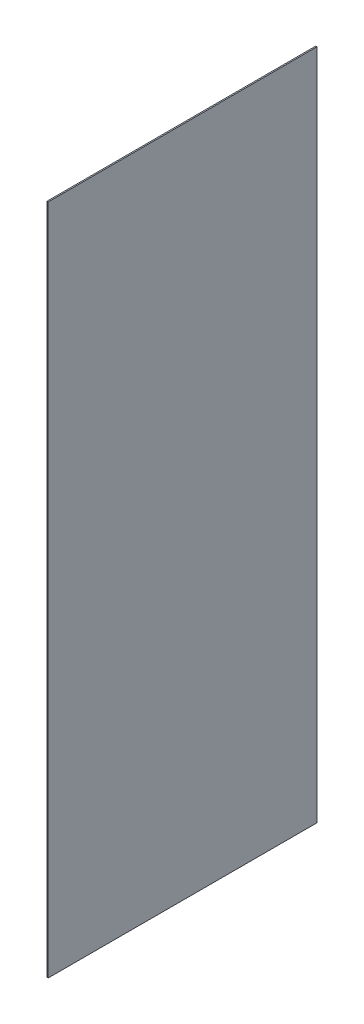
ISO-10303-21;
HEADER;
FILE_DESCRIPTION(('STEP AP214'),'2;1');
FILE_NAME('part.step','',(''),(''),'','','');
FILE_SCHEMA(('AUTOMOTIVE_DESIGN { 1 0 10303 214 1 1 1 1 }'));
ENDSEC;
DATA;
#1=APPLICATION_CONTEXT('core data for automotive mechanical design processes');
#2=APPLICATION_PROTOCOL_DEFINITION('international standard','automotive_design',2000,#1);
#3=PRODUCT_CONTEXT('',#1,'mechanical');
#4=PRODUCT('Part','Part','',(#3));
#5=PRODUCT_RELATED_PRODUCT_CATEGORY('part','',(#4));
#6=PRODUCT_DEFINITION_FORMATION('','',#4);
#7=PRODUCT_DEFINITION_CONTEXT('part definition',#1,'design');
#8=PRODUCT_DEFINITION('design','',#6,#7);
#9=PRODUCT_DEFINITION_SHAPE('','',#8);
#10=(LENGTH_UNIT() NAMED_UNIT(*) SI_UNIT(.MILLI.,.METRE.));
#11=(NAMED_UNIT(*) PLANE_ANGLE_UNIT() SI_UNIT($,.RADIAN.));
#12=(NAMED_UNIT(*) SI_UNIT($,.STERADIAN.) SOLID_ANGLE_UNIT());
#13=UNCERTAINTY_MEASURE_WITH_UNIT(LENGTH_MEASURE(1.E-05),#10,'distance_accuracy_value','');
#14=(GEOMETRIC_REPRESENTATION_CONTEXT(3) GLOBAL_UNCERTAINTY_ASSIGNED_CONTEXT((#13)) GLOBAL_UNIT_ASSIGNED_CONTEXT((#10,
#11,#12)) REPRESENTATION_CONTEXT('',''));
#15=CARTESIAN_POINT('',(0.,0.,0.));
#16=DIRECTION('',(0.,0.,1.));
#17=DIRECTION('',(1.,0.,0.));
#18=AXIS2_PLACEMENT_3D('',#15,#16,#17);
#19=CARTESIAN_POINT('',(-1.2,-325.,130.));
#20=DIRECTION('',(0.,0.,1.));
#21=DIRECTION('',(1.,0.,0.));
#22=AXIS2_PLACEMENT_3D('',#19,#20,#21);
#23=PLANE('',#22);
#24=DIRECTION('',(0.,-1.,0.));
#25=VECTOR('',#24,1.);
#26=CARTESIAN_POINT('',(0.,-325.,130.));
#27=LINE('',#26,#25);
#28=CARTESIAN_POINT('',(0.,325.,130.));
#29=VERTEX_POINT('',#28);
#30=CARTESIAN_POINT('',(0.,-325.,130.));
#31=VERTEX_POINT('',#30);
#32=EDGE_CURVE('E107',#29,#31,#27,.T.);
#33=ORIENTED_EDGE('',*,*,#32,.F.);
#34=DIRECTION('',(1.,0.,0.));
#35=VECTOR('',#34,1.);
#36=CARTESIAN_POINT('',(-1.2,325.,130.));
#37=LINE('',#36,#35);
#38=CARTESIAN_POINT('',(-1.2,325.,130.));
#39=VERTEX_POINT('',#38);
#40=EDGE_CURVE('E11',#39,#29,#37,.T.);
#41=ORIENTED_EDGE('',*,*,#40,.F.);
#42=DIRECTION('',(0.,-1.,0.));
#43=VECTOR('',#42,1.);
#44=CARTESIAN_POINT('',(-1.2,-325.,130.));
#45=LINE('',#44,#43);
#46=CARTESIAN_POINT('',(-1.2,-325.,130.));
#47=VERTEX_POINT('',#46);
#48=EDGE_CURVE('E101',#39,#47,#45,.T.);
#49=ORIENTED_EDGE('',*,*,#48,.T.);
#50=DIRECTION('',(1.,0.,0.));
#51=VECTOR('',#50,1.);
#52=CARTESIAN_POINT('',(-1.2,-325.,130.));
#53=LINE('',#52,#51);
#54=EDGE_CURVE('E46',#47,#31,#53,.T.);
#55=ORIENTED_EDGE('',*,*,#54,.T.);
#56=EDGE_LOOP('',(#33,#41,#49,#55));
#57=FACE_BOUND('',#56,.T.);
#58=ADVANCED_FACE('F43',(#57),#23,.T.);
#59=CARTESIAN_POINT('',(-1.2,325.,-130.));
#60=DIRECTION('',(0.,1.,0.));
#61=DIRECTION('',(0.,0.,1.));
#62=AXIS2_PLACEMENT_3D('',#59,#60,#61);
#63=PLANE('',#62);
#64=DIRECTION('',(0.,0.,1.));
#65=VECTOR('',#64,1.);
#66=CARTESIAN_POINT('',(0.,325.,-130.));
#67=LINE('',#66,#65);
#68=CARTESIAN_POINT('',(0.,325.,-130.));
#69=VERTEX_POINT('',#68);
#70=EDGE_CURVE('E103',#69,#29,#67,.T.);
#71=ORIENTED_EDGE('',*,*,#70,.F.);
#72=DIRECTION('',(1.,0.,0.));
#73=VECTOR('',#72,1.);
#74=CARTESIAN_POINT('',(-1.2,325.,-130.));
#75=LINE('',#74,#73);
#76=CARTESIAN_POINT('',(-1.2,325.,-130.));
#77=VERTEX_POINT('',#76);
#78=EDGE_CURVE('E52',#77,#69,#75,.T.);
#79=ORIENTED_EDGE('',*,*,#78,.F.);
#80=DIRECTION('',(0.,0.,1.));
#81=VECTOR('',#80,1.);
#82=CARTESIAN_POINT('',(-1.2,325.,-130.));
#83=LINE('',#82,#81);
#84=EDGE_CURVE('E98',#77,#39,#83,.T.);
#85=ORIENTED_EDGE('',*,*,#84,.T.);
#86=ORIENTED_EDGE('',*,*,#40,.T.);
#87=EDGE_LOOP('',(#71,#79,#85,#86));
#88=FACE_BOUND('',#87,.T.);
#89=ADVANCED_FACE('F117',(#88),#63,.T.);
#90=CARTESIAN_POINT('',(-1.2,-325.,-130.));
#91=DIRECTION('',(0.,0.,-1.));
#92=DIRECTION('',(-1.,0.,0.));
#93=AXIS2_PLACEMENT_3D('',#90,#91,#92);
#94=PLANE('',#93);
#95=DIRECTION('',(0.,1.,0.));
#96=VECTOR('',#95,1.);
#97=CARTESIAN_POINT('',(0.,-325.,-130.));
#98=LINE('',#97,#96);
#99=CARTESIAN_POINT('',(0.,-325.,-130.));
#100=VERTEX_POINT('',#99);
#101=EDGE_CURVE('E93',#100,#69,#98,.T.);
#102=ORIENTED_EDGE('',*,*,#101,.F.);
#103=DIRECTION('',(1.,0.,0.));
#104=VECTOR('',#103,1.);
#105=CARTESIAN_POINT('',(-1.2,-325.,-130.));
#106=LINE('',#105,#104);
#107=CARTESIAN_POINT('',(-1.2,-325.,-130.));
#108=VERTEX_POINT('',#107);
#109=EDGE_CURVE('E88',#108,#100,#106,.T.);
#110=ORIENTED_EDGE('',*,*,#109,.F.);
#111=DIRECTION('',(0.,1.,0.));
#112=VECTOR('',#111,1.);
#113=CARTESIAN_POINT('',(-1.2,-325.,-130.));
#114=LINE('',#113,#112);
#115=EDGE_CURVE('E91',#108,#77,#114,.T.);
#116=ORIENTED_EDGE('',*,*,#115,.T.);
#117=ORIENTED_EDGE('',*,*,#78,.T.);
#118=EDGE_LOOP('',(#102,#110,#116,#117));
#119=FACE_BOUND('',#118,.T.);
#120=ADVANCED_FACE('F90',(#119),#94,.T.);
#121=CARTESIAN_POINT('',(-1.2,-325.,-130.));
#122=DIRECTION('',(0.,-1.,0.));
#123=DIRECTION('',(0.,0.,-1.));
#124=AXIS2_PLACEMENT_3D('',#121,#122,#123);
#125=PLANE('',#124);
#126=DIRECTION('',(0.,0.,-1.));
#127=VECTOR('',#126,1.);
#128=CARTESIAN_POINT('',(0.,-325.,-130.));
#129=LINE('',#128,#127);
#130=EDGE_CURVE('E110',#31,#100,#129,.T.);
#131=ORIENTED_EDGE('',*,*,#130,.F.);
#132=ORIENTED_EDGE('',*,*,#54,.F.);
#133=DIRECTION('',(0.,0.,-1.));
#134=VECTOR('',#133,1.);
#135=CARTESIAN_POINT('',(-1.2,-325.,-130.));
#136=LINE('',#135,#134);
#137=EDGE_CURVE('E97',#47,#108,#136,.T.);
#138=ORIENTED_EDGE('',*,*,#137,.T.);
#139=ORIENTED_EDGE('',*,*,#109,.T.);
#140=EDGE_LOOP('',(#131,#132,#138,#139));
#141=FACE_BOUND('',#140,.T.);
#142=ADVANCED_FACE('F100',(#141),#125,.T.);
#143=CARTESIAN_POINT('',(-1.2,0.,0.));
#144=DIRECTION('',(1.,0.,0.));
#145=DIRECTION('',(0.,0.,-1.));
#146=AXIS2_PLACEMENT_3D('',#143,#144,#145);
#147=PLANE('',#146);
#148=ORIENTED_EDGE('',*,*,#48,.F.);
#149=ORIENTED_EDGE('',*,*,#84,.F.);
#150=ORIENTED_EDGE('',*,*,#115,.F.);
#151=ORIENTED_EDGE('',*,*,#137,.F.);
#152=EDGE_LOOP('',(#148,#149,#150,#151));
#153=FACE_BOUND('',#152,.T.);
#154=ADVANCED_FACE('F96',(#153),#147,.F.);
#155=CARTESIAN_POINT('',(0.,0.,0.));
#156=DIRECTION('',(1.,0.,0.));
#157=DIRECTION('',(0.,0.,-1.));
#158=AXIS2_PLACEMENT_3D('',#155,#156,#157);
#159=PLANE('',#158);
#160=ORIENTED_EDGE('',*,*,#32,.T.);
#161=ORIENTED_EDGE('',*,*,#130,.T.);
#162=ORIENTED_EDGE('',*,*,#101,.T.);
#163=ORIENTED_EDGE('',*,*,#70,.T.);
#164=EDGE_LOOP('',(#160,#161,#162,#163));
#165=FACE_BOUND('',#164,.T.);
#166=ADVANCED_FACE('F116',(#165),#159,.T.);
#167=CLOSED_SHELL('',(#58,#89,#120,#142,#154,#166));
#168=MANIFOLD_SOLID_BREP('B2',#167);
#169=ADVANCED_BREP_SHAPE_REPRESENTATION('',(#18,#168),#14);
#170=SHAPE_DEFINITION_REPRESENTATION(#9,#169);
ENDSEC;
END-ISO-10303-21;
